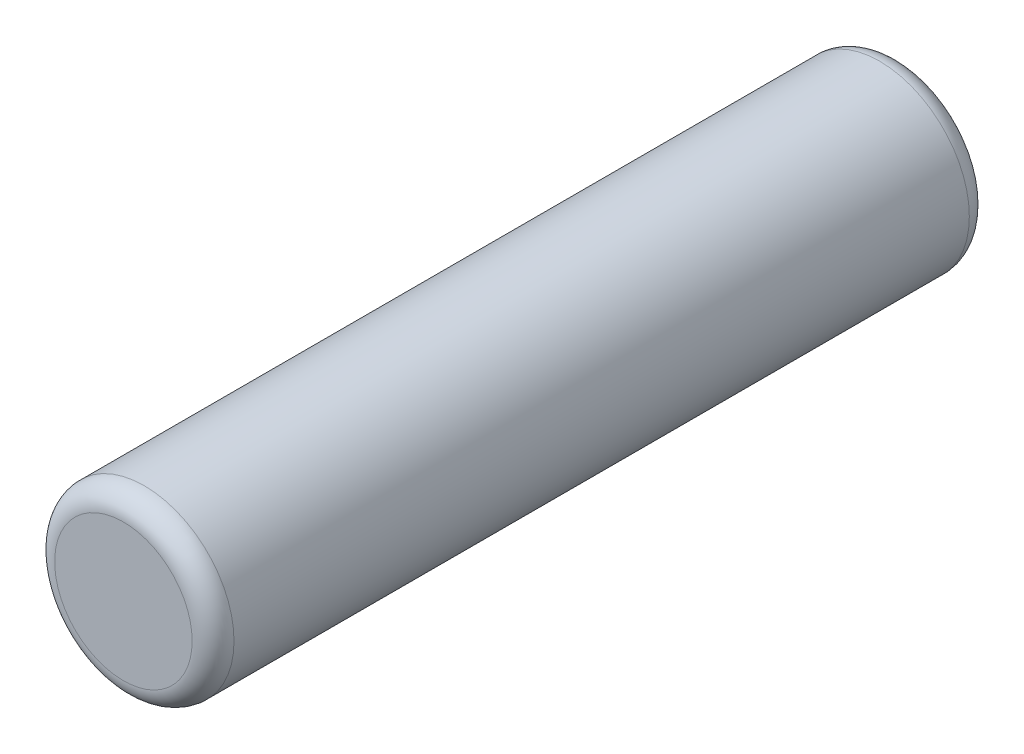
ISO-10303-21;
HEADER;
FILE_DESCRIPTION(('STEP AP214'),'2;1');
FILE_NAME('part.step','',(''),(''),'','','');
FILE_SCHEMA(('AUTOMOTIVE_DESIGN { 1 0 10303 214 1 1 1 1 }'));
ENDSEC;
DATA;
#1=APPLICATION_CONTEXT('core data for automotive mechanical design processes');
#2=APPLICATION_PROTOCOL_DEFINITION('international standard','automotive_design',2000,#1);
#3=PRODUCT_CONTEXT('',#1,'mechanical');
#4=PRODUCT('Part','Part','',(#3));
#5=PRODUCT_RELATED_PRODUCT_CATEGORY('part','',(#4));
#6=PRODUCT_DEFINITION_FORMATION('','',#4);
#7=PRODUCT_DEFINITION_CONTEXT('part definition',#1,'design');
#8=PRODUCT_DEFINITION('design','',#6,#7);
#9=PRODUCT_DEFINITION_SHAPE('','',#8);
#10=(LENGTH_UNIT() NAMED_UNIT(*) SI_UNIT(.MILLI.,.METRE.));
#11=(NAMED_UNIT(*) PLANE_ANGLE_UNIT() SI_UNIT($,.RADIAN.));
#12=(NAMED_UNIT(*) SI_UNIT($,.STERADIAN.) SOLID_ANGLE_UNIT());
#13=UNCERTAINTY_MEASURE_WITH_UNIT(LENGTH_MEASURE(1.E-05),#10,'distance_accuracy_value','');
#14=(GEOMETRIC_REPRESENTATION_CONTEXT(3) GLOBAL_UNCERTAINTY_ASSIGNED_CONTEXT((#13)) GLOBAL_UNIT_ASSIGNED_CONTEXT((#10,
#11,#12)) REPRESENTATION_CONTEXT('',''));
#15=CARTESIAN_POINT('',(0.,0.,0.));
#16=DIRECTION('',(0.,0.,1.));
#17=DIRECTION('',(1.,0.,0.));
#18=AXIS2_PLACEMENT_3D('',#15,#16,#17);
#19=CARTESIAN_POINT('',(0.,0.,6.5));
#20=DIRECTION('',(0.,0.,-1.));
#21=DIRECTION('',(-1.,0.,0.));
#22=AXIS2_PLACEMENT_3D('',#19,#20,#21);
#23=CYLINDRICAL_SURFACE('',#22,1.5);
#24=CARTESIAN_POINT('',(0.,0.,-6.15));
#25=DIRECTION('',(0.,0.,1.));
#26=DIRECTION('',(1.,0.,0.));
#27=AXIS2_PLACEMENT_3D('',#24,#25,#26);
#28=CIRCLE('',#27,1.5);
#29=CARTESIAN_POINT('',(1.5,0.,-6.15));
#30=VERTEX_POINT('',#29);
#31=EDGE_CURVE('E42',#30,#30,#28,.T.);
#32=ORIENTED_EDGE('',*,*,#31,.T.);
#33=EDGE_LOOP('',(#32));
#34=FACE_BOUND('',#33,.T.);
#35=CARTESIAN_POINT('',(0.,0.,6.15));
#36=DIRECTION('',(0.,0.,1.));
#37=DIRECTION('',(1.,0.,0.));
#38=AXIS2_PLACEMENT_3D('',#35,#36,#37);
#39=CIRCLE('',#38,1.5);
#40=CARTESIAN_POINT('',(1.5,0.,6.15));
#41=VERTEX_POINT('',#40);
#42=EDGE_CURVE('E46',#41,#41,#39,.F.);
#43=ORIENTED_EDGE('',*,*,#42,.T.);
#44=EDGE_LOOP('',(#43));
#45=FACE_BOUND('',#44,.T.);
#46=ADVANCED_FACE('F31',(#34,#45),#23,.T.);
#47=CARTESIAN_POINT('',(0.,0.,6.5));
#48=DIRECTION('',(0.,0.,1.));
#49=DIRECTION('',(1.,0.,0.));
#50=AXIS2_PLACEMENT_3D('',#47,#48,#49);
#51=PLANE('',#50);
#52=CARTESIAN_POINT('',(0.,0.,6.5));
#53=DIRECTION('',(0.,0.,1.));
#54=DIRECTION('',(1.,0.,0.));
#55=AXIS2_PLACEMENT_3D('',#52,#53,#54);
#56=CIRCLE('',#55,1.15);
#57=CARTESIAN_POINT('',(1.15,0.,6.5));
#58=VERTEX_POINT('',#57);
#59=EDGE_CURVE('E10',#58,#58,#56,.T.);
#60=ORIENTED_EDGE('',*,*,#59,.T.);
#61=EDGE_LOOP('',(#60));
#62=FACE_BOUND('',#61,.T.);
#63=ADVANCED_FACE('F62',(#62),#51,.T.);
#64=CARTESIAN_POINT('',(0.,0.,-6.5));
#65=DIRECTION('',(0.,0.,1.));
#66=DIRECTION('',(1.,0.,0.));
#67=AXIS2_PLACEMENT_3D('',#64,#65,#66);
#68=PLANE('',#67);
#69=CARTESIAN_POINT('',(0.,0.,-6.5));
#70=DIRECTION('',(0.,0.,1.));
#71=DIRECTION('',(1.,0.,0.));
#72=AXIS2_PLACEMENT_3D('',#69,#70,#71);
#73=CIRCLE('',#72,1.15);
#74=CARTESIAN_POINT('',(1.15,0.,-6.5));
#75=VERTEX_POINT('',#74);
#76=EDGE_CURVE('E38',#75,#75,#73,.F.);
#77=ORIENTED_EDGE('',*,*,#76,.T.);
#78=EDGE_LOOP('',(#77));
#79=FACE_BOUND('',#78,.T.);
#80=ADVANCED_FACE('F59',(#79),#68,.F.);
#81=CARTESIAN_POINT('',(0.,0.,-6.15));
#82=DIRECTION('',(0.,0.,1.));
#83=DIRECTION('',(1.,0.,0.));
#84=AXIS2_PLACEMENT_3D('',#81,#82,#83);
#85=TOROIDAL_SURFACE('',#84,1.15,0.35);
#86=ORIENTED_EDGE('',*,*,#76,.F.);
#87=EDGE_LOOP('',(#86));
#88=FACE_BOUND('',#87,.T.);
#89=ORIENTED_EDGE('',*,*,#31,.F.);
#90=EDGE_LOOP('',(#89));
#91=FACE_BOUND('',#90,.T.);
#92=ADVANCED_FACE('F55',(#88,#91),#85,.T.);
#93=CARTESIAN_POINT('',(0.,0.,6.15));
#94=DIRECTION('',(0.,0.,1.));
#95=DIRECTION('',(1.,0.,0.));
#96=AXIS2_PLACEMENT_3D('',#93,#94,#95);
#97=TOROIDAL_SURFACE('',#96,1.15,0.35);
#98=ORIENTED_EDGE('',*,*,#42,.F.);
#99=EDGE_LOOP('',(#98));
#100=FACE_BOUND('',#99,.T.);
#101=ORIENTED_EDGE('',*,*,#59,.F.);
#102=EDGE_LOOP('',(#101));
#103=FACE_BOUND('',#102,.T.);
#104=ADVANCED_FACE('F33',(#100,#103),#97,.T.);
#105=CLOSED_SHELL('',(#46,#63,#80,#92,#104));
#106=MANIFOLD_SOLID_BREP('B2',#105);
#107=ADVANCED_BREP_SHAPE_REPRESENTATION('',(#18,#106),#14);
#108=SHAPE_DEFINITION_REPRESENTATION(#9,#107);
ENDSEC;
END-ISO-10303-21;
